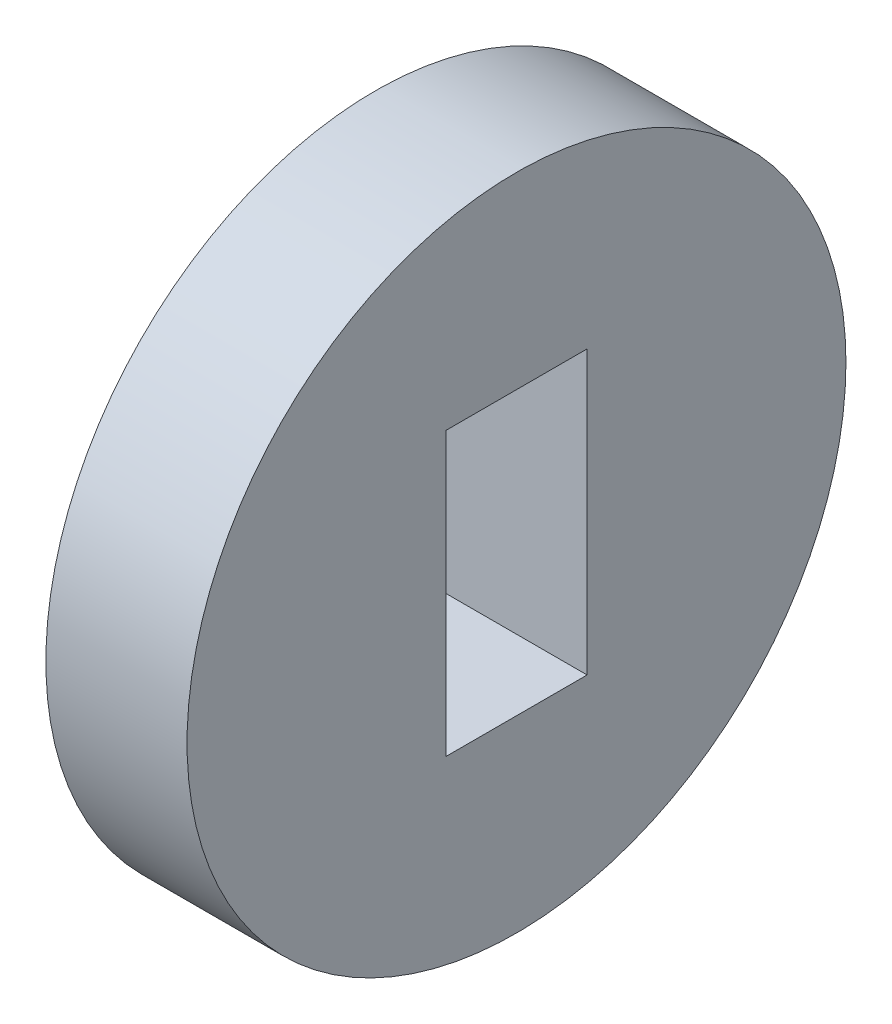
ISO-10303-21;
HEADER;
FILE_DESCRIPTION(('STEP AP214'),'2;1');
FILE_NAME('part.step','',(''),(''),'','','');
FILE_SCHEMA(('AUTOMOTIVE_DESIGN { 1 0 10303 214 1 1 1 1 }'));
ENDSEC;
DATA;
#1=APPLICATION_CONTEXT('core data for automotive mechanical design processes');
#2=APPLICATION_PROTOCOL_DEFINITION('international standard','automotive_design',2000,#1);
#3=PRODUCT_CONTEXT('',#1,'mechanical');
#4=PRODUCT('Part','Part','',(#3));
#5=PRODUCT_RELATED_PRODUCT_CATEGORY('part','',(#4));
#6=PRODUCT_DEFINITION_FORMATION('','',#4);
#7=PRODUCT_DEFINITION_CONTEXT('part definition',#1,'design');
#8=PRODUCT_DEFINITION('design','',#6,#7);
#9=PRODUCT_DEFINITION_SHAPE('','',#8);
#10=(LENGTH_UNIT() NAMED_UNIT(*) SI_UNIT(.MILLI.,.METRE.));
#11=(NAMED_UNIT(*) PLANE_ANGLE_UNIT() SI_UNIT($,.RADIAN.));
#12=(NAMED_UNIT(*) SI_UNIT($,.STERADIAN.) SOLID_ANGLE_UNIT());
#13=UNCERTAINTY_MEASURE_WITH_UNIT(LENGTH_MEASURE(1.E-05),#10,'distance_accuracy_value','');
#14=(GEOMETRIC_REPRESENTATION_CONTEXT(3) GLOBAL_UNCERTAINTY_ASSIGNED_CONTEXT((#13)) GLOBAL_UNIT_ASSIGNED_CONTEXT((#10,
#11,#12)) REPRESENTATION_CONTEXT('',''));
#15=CARTESIAN_POINT('',(0.,0.,0.));
#16=DIRECTION('',(0.,0.,1.));
#17=DIRECTION('',(1.,0.,0.));
#18=AXIS2_PLACEMENT_3D('',#15,#16,#17);
#19=CARTESIAN_POINT('',(3.,-25.575682470954,0.));
#20=DIRECTION('',(0.,1.,0.));
#21=DIRECTION('',(0.,0.,1.));
#22=AXIS2_PLACEMENT_3D('',#19,#20,#21);
#23=PLANE('',#22);
#24=DIRECTION('',(0.,0.,-1.));
#25=VECTOR('',#24,1.);
#26=CARTESIAN_POINT('',(0.,-25.575682470954,0.));
#27=LINE('',#26,#25);
#28=CARTESIAN_POINT('',(0.,-25.575682470954,8.76898181721936));
#29=VERTEX_POINT('',#28);
#30=CARTESIAN_POINT('',(0.,-25.575682470954,5.76898181721936));
#31=VERTEX_POINT('',#30);
#32=EDGE_CURVE('E102',#29,#31,#27,.T.);
#33=ORIENTED_EDGE('',*,*,#32,.F.);
#34=DIRECTION('',(-1.,0.,0.));
#35=VECTOR('',#34,1.);
#36=CARTESIAN_POINT('',(3.,-25.575682470954,8.76898181721936));
#37=LINE('',#36,#35);
#38=CARTESIAN_POINT('',(3.,-25.575682470954,8.76898181721936));
#39=VERTEX_POINT('',#38);
#40=EDGE_CURVE('E11',#39,#29,#37,.T.);
#41=ORIENTED_EDGE('',*,*,#40,.F.);
#42=DIRECTION('',(0.,0.,-1.));
#43=VECTOR('',#42,1.);
#44=CARTESIAN_POINT('',(3.,-25.575682470954,0.));
#45=LINE('',#44,#43);
#46=CARTESIAN_POINT('',(3.,-25.575682470954,5.76898181721936));
#47=VERTEX_POINT('',#46);
#48=EDGE_CURVE('E93',#39,#47,#45,.T.);
#49=ORIENTED_EDGE('',*,*,#48,.T.);
#50=DIRECTION('',(-1.,0.,0.));
#51=VECTOR('',#50,1.);
#52=CARTESIAN_POINT('',(3.,-25.575682470954,5.76898181721936));
#53=LINE('',#52,#51);
#54=EDGE_CURVE('E73',#47,#31,#53,.T.);
#55=ORIENTED_EDGE('',*,*,#54,.T.);
#56=EDGE_LOOP('',(#33,#41,#49,#55));
#57=FACE_BOUND('',#56,.T.);
#58=ADVANCED_FACE('F35',(#57),#23,.T.);
#59=CARTESIAN_POINT('',(3.,0.,8.76898181721936));
#60=DIRECTION('',(0.,0.,-1.));
#61=DIRECTION('',(-1.,0.,0.));
#62=AXIS2_PLACEMENT_3D('',#59,#60,#61);
#63=PLANE('',#62);
#64=DIRECTION('',(0.,-1.,0.));
#65=VECTOR('',#64,1.);
#66=CARTESIAN_POINT('',(0.,0.,8.76898181721936));
#67=LINE('',#66,#65);
#68=CARTESIAN_POINT('',(0.,-19.575682470954,8.76898181721936));
#69=VERTEX_POINT('',#68);
#70=EDGE_CURVE('E86',#69,#29,#67,.T.);
#71=ORIENTED_EDGE('',*,*,#70,.F.);
#72=DIRECTION('',(-1.,0.,0.));
#73=VECTOR('',#72,1.);
#74=CARTESIAN_POINT('',(3.,-19.575682470954,8.76898181721936));
#75=LINE('',#74,#73);
#76=CARTESIAN_POINT('',(3.,-19.575682470954,8.76898181721936));
#77=VERTEX_POINT('',#76);
#78=EDGE_CURVE('E43',#77,#69,#75,.T.);
#79=ORIENTED_EDGE('',*,*,#78,.F.);
#80=DIRECTION('',(0.,-1.,0.));
#81=VECTOR('',#80,1.);
#82=CARTESIAN_POINT('',(3.,0.,8.76898181721936));
#83=LINE('',#82,#81);
#84=EDGE_CURVE('E84',#77,#39,#83,.T.);
#85=ORIENTED_EDGE('',*,*,#84,.T.);
#86=ORIENTED_EDGE('',*,*,#40,.T.);
#87=EDGE_LOOP('',(#71,#79,#85,#86));
#88=FACE_BOUND('',#87,.T.);
#89=ADVANCED_FACE('F82',(#88),#63,.T.);
#90=CARTESIAN_POINT('',(3.,-19.575682470954,0.));
#91=DIRECTION('',(0.,1.,0.));
#92=DIRECTION('',(0.,0.,1.));
#93=AXIS2_PLACEMENT_3D('',#90,#91,#92);
#94=PLANE('',#93);
#95=DIRECTION('',(0.,0.,-1.));
#96=VECTOR('',#95,1.);
#97=CARTESIAN_POINT('',(0.,-19.575682470954,0.));
#98=LINE('',#97,#96);
#99=CARTESIAN_POINT('',(0.,-19.575682470954,5.76898181721936));
#100=VERTEX_POINT('',#99);
#101=EDGE_CURVE('E66',#69,#100,#98,.T.);
#102=ORIENTED_EDGE('',*,*,#101,.T.);
#103=DIRECTION('',(-1.,0.,0.));
#104=VECTOR('',#103,1.);
#105=CARTESIAN_POINT('',(3.,-19.575682470954,5.76898181721936));
#106=LINE('',#105,#104);
#107=CARTESIAN_POINT('',(3.,-19.575682470954,5.76898181721936));
#108=VERTEX_POINT('',#107);
#109=EDGE_CURVE('E87',#108,#100,#106,.T.);
#110=ORIENTED_EDGE('',*,*,#109,.F.);
#111=DIRECTION('',(0.,0.,-1.));
#112=VECTOR('',#111,1.);
#113=CARTESIAN_POINT('',(3.,-19.575682470954,0.));
#114=LINE('',#113,#112);
#115=EDGE_CURVE('E88',#77,#108,#114,.T.);
#116=ORIENTED_EDGE('',*,*,#115,.F.);
#117=ORIENTED_EDGE('',*,*,#78,.T.);
#118=EDGE_LOOP('',(#102,#110,#116,#117));
#119=FACE_BOUND('',#118,.T.);
#120=ADVANCED_FACE('F89',(#119),#94,.F.);
#121=CARTESIAN_POINT('',(3.,0.,5.76898181721936));
#122=DIRECTION('',(0.,0.,-1.));
#123=DIRECTION('',(-1.,0.,0.));
#124=AXIS2_PLACEMENT_3D('',#121,#122,#123);
#125=PLANE('',#124);
#126=DIRECTION('',(0.,-1.,0.));
#127=VECTOR('',#126,1.);
#128=CARTESIAN_POINT('',(0.,0.,5.76898181721936));
#129=LINE('',#128,#127);
#130=EDGE_CURVE('E107',#100,#31,#129,.T.);
#131=ORIENTED_EDGE('',*,*,#130,.T.);
#132=ORIENTED_EDGE('',*,*,#54,.F.);
#133=DIRECTION('',(0.,-1.,0.));
#134=VECTOR('',#133,1.);
#135=CARTESIAN_POINT('',(3.,0.,5.76898181721936));
#136=LINE('',#135,#134);
#137=EDGE_CURVE('E51',#108,#47,#136,.T.);
#138=ORIENTED_EDGE('',*,*,#137,.F.);
#139=ORIENTED_EDGE('',*,*,#109,.T.);
#140=EDGE_LOOP('',(#131,#132,#138,#139));
#141=FACE_BOUND('',#140,.T.);
#142=ADVANCED_FACE('F114',(#141),#125,.F.);
#143=CARTESIAN_POINT('',(3.,-22.575682470954,7.26898181721936));
#144=DIRECTION('',(-1.,0.,0.));
#145=DIRECTION('',(0.,0.,1.));
#146=AXIS2_PLACEMENT_3D('',#143,#144,#145);
#147=CYLINDRICAL_SURFACE('',#146,7.);
#148=CARTESIAN_POINT('',(3.,-22.575682470954,7.26898181721936));
#149=DIRECTION('',(1.,0.,0.));
#150=DIRECTION('',(0.,0.,-1.));
#151=AXIS2_PLACEMENT_3D('',#148,#149,#150);
#152=CIRCLE('',#151,7.);
#153=CARTESIAN_POINT('',(3.,-22.575682470954,0.268981817219359));
#154=VERTEX_POINT('',#153);
#155=EDGE_CURVE('E99',#154,#154,#152,.T.);
#156=ORIENTED_EDGE('',*,*,#155,.F.);
#157=EDGE_LOOP('',(#156));
#158=FACE_BOUND('',#157,.T.);
#159=CARTESIAN_POINT('',(0.,-22.575682470954,7.26898181721936));
#160=DIRECTION('',(1.,0.,0.));
#161=DIRECTION('',(0.,0.,-1.));
#162=AXIS2_PLACEMENT_3D('',#159,#160,#161);
#163=CIRCLE('',#162,7.);
#164=CARTESIAN_POINT('',(0.,-22.575682470954,0.268981817219359));
#165=VERTEX_POINT('',#164);
#166=EDGE_CURVE('E95',#165,#165,#163,.T.);
#167=ORIENTED_EDGE('',*,*,#166,.T.);
#168=EDGE_LOOP('',(#167));
#169=FACE_BOUND('',#168,.T.);
#170=ADVANCED_FACE('F129',(#158,#169),#147,.T.);
#171=CARTESIAN_POINT('',(3.,0.,0.));
#172=DIRECTION('',(1.,0.,0.));
#173=DIRECTION('',(0.,0.,-1.));
#174=AXIS2_PLACEMENT_3D('',#171,#172,#173);
#175=PLANE('',#174);
#176=ORIENTED_EDGE('',*,*,#48,.F.);
#177=ORIENTED_EDGE('',*,*,#84,.F.);
#178=ORIENTED_EDGE('',*,*,#115,.T.);
#179=ORIENTED_EDGE('',*,*,#137,.T.);
#180=EDGE_LOOP('',(#176,#177,#178,#179));
#181=FACE_BOUND('',#180,.T.);
#182=ORIENTED_EDGE('',*,*,#155,.T.);
#183=EDGE_LOOP('',(#182));
#184=FACE_BOUND('',#183,.T.);
#185=ADVANCED_FACE('F91',(#181,#184),#175,.T.);
#186=CARTESIAN_POINT('',(0.,0.,0.));
#187=DIRECTION('',(1.,0.,0.));
#188=DIRECTION('',(0.,0.,-1.));
#189=AXIS2_PLACEMENT_3D('',#186,#187,#188);
#190=PLANE('',#189);
#191=ORIENTED_EDGE('',*,*,#32,.T.);
#192=ORIENTED_EDGE('',*,*,#130,.F.);
#193=ORIENTED_EDGE('',*,*,#101,.F.);
#194=ORIENTED_EDGE('',*,*,#70,.T.);
#195=EDGE_LOOP('',(#191,#192,#193,#194));
#196=FACE_BOUND('',#195,.T.);
#197=ORIENTED_EDGE('',*,*,#166,.F.);
#198=EDGE_LOOP('',(#197));
#199=FACE_BOUND('',#198,.T.);
#200=ADVANCED_FACE('F116',(#196,#199),#190,.F.);
#201=CLOSED_SHELL('',(#58,#89,#120,#142,#170,#185,#200));
#202=MANIFOLD_SOLID_BREP('B2',#201);
#203=ADVANCED_BREP_SHAPE_REPRESENTATION('',(#18,#202),#14);
#204=SHAPE_DEFINITION_REPRESENTATION(#9,#203);
ENDSEC;
END-ISO-10303-21;
